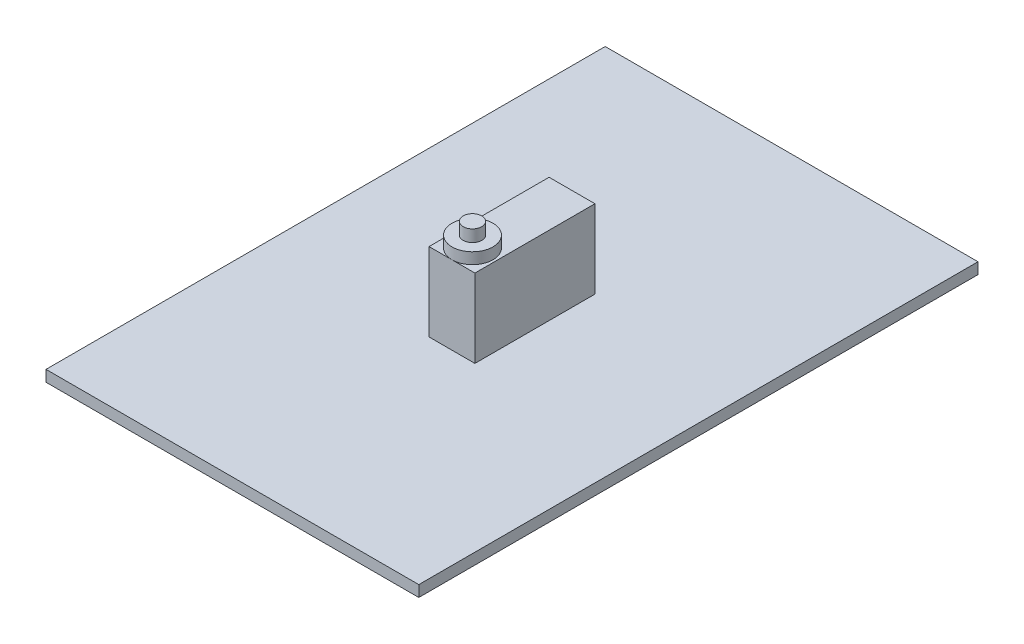
ISO-10303-21;
HEADER;
FILE_DESCRIPTION(('STEP AP214'),'2;1');
FILE_NAME('part.step','',(''),(''),'','','');
FILE_SCHEMA(('AUTOMOTIVE_DESIGN { 1 0 10303 214 1 1 1 1 }'));
ENDSEC;
DATA;
#1=APPLICATION_CONTEXT('core data for automotive mechanical design processes');
#2=APPLICATION_PROTOCOL_DEFINITION('international standard','automotive_design',2000,#1);
#3=PRODUCT_CONTEXT('',#1,'mechanical');
#4=PRODUCT('Part','Part','',(#3));
#5=PRODUCT_RELATED_PRODUCT_CATEGORY('part','',(#4));
#6=PRODUCT_DEFINITION_FORMATION('','',#4);
#7=PRODUCT_DEFINITION_CONTEXT('part definition',#1,'design');
#8=PRODUCT_DEFINITION('design','',#6,#7);
#9=PRODUCT_DEFINITION_SHAPE('','',#8);
#10=(LENGTH_UNIT() NAMED_UNIT(*) SI_UNIT(.MILLI.,.METRE.));
#11=(NAMED_UNIT(*) PLANE_ANGLE_UNIT() SI_UNIT($,.RADIAN.));
#12=(NAMED_UNIT(*) SI_UNIT($,.STERADIAN.) SOLID_ANGLE_UNIT());
#13=UNCERTAINTY_MEASURE_WITH_UNIT(LENGTH_MEASURE(1.E-05),#10,'distance_accuracy_value','');
#14=(GEOMETRIC_REPRESENTATION_CONTEXT(3) GLOBAL_UNCERTAINTY_ASSIGNED_CONTEXT((#13)) GLOBAL_UNIT_ASSIGNED_CONTEXT((#10,
#11,#12)) REPRESENTATION_CONTEXT('',''));
#15=CARTESIAN_POINT('',(0.,0.,0.));
#16=DIRECTION('',(0.,0.,1.));
#17=DIRECTION('',(1.,0.,0.));
#18=AXIS2_PLACEMENT_3D('',#15,#16,#17);
#19=CARTESIAN_POINT('',(0.,1.5,-150.));
#20=DIRECTION('',(0.,1.,0.));
#21=DIRECTION('',(-1.,0.,0.));
#22=AXIS2_PLACEMENT_3D('',#19,#20,#21);
#23=PLANE('',#22);
#24=DIRECTION('',(-1.,0.,0.));
#25=VECTOR('',#24,1.);
#26=CARTESIAN_POINT('',(0.,1.5,0.));
#27=LINE('',#26,#25);
#28=CARTESIAN_POINT('',(50.,1.50000000000001,0.));
#29=VERTEX_POINT('',#28);
#30=CARTESIAN_POINT('',(-50.,1.49999999999999,0.));
#31=VERTEX_POINT('',#30);
#32=EDGE_CURVE('E169',#29,#31,#27,.T.);
#33=ORIENTED_EDGE('',*,*,#32,.F.);
#34=DIRECTION('',(0.,0.,1.));
#35=VECTOR('',#34,1.);
#36=CARTESIAN_POINT('',(50.,1.50000000000001,-150.));
#37=LINE('',#36,#35);
#38=CARTESIAN_POINT('',(50.,1.50000000000001,-150.));
#39=VERTEX_POINT('',#38);
#40=EDGE_CURVE('E195',#39,#29,#37,.T.);
#41=ORIENTED_EDGE('',*,*,#40,.F.);
#42=DIRECTION('',(-1.,0.,0.));
#43=VECTOR('',#42,1.);
#44=CARTESIAN_POINT('',(0.,1.5,-150.));
#45=LINE('',#44,#43);
#46=CARTESIAN_POINT('',(-50.,1.49999999999999,-150.));
#47=VERTEX_POINT('',#46);
#48=EDGE_CURVE('E176',#39,#47,#45,.T.);
#49=ORIENTED_EDGE('',*,*,#48,.T.);
#50=DIRECTION('',(0.,0.,1.));
#51=VECTOR('',#50,1.);
#52=CARTESIAN_POINT('',(-50.,1.49999999999999,-150.));
#53=LINE('',#52,#51);
#54=EDGE_CURVE('E92',#47,#31,#53,.T.);
#55=ORIENTED_EDGE('',*,*,#54,.T.);
#56=EDGE_LOOP('',(#33,#41,#49,#55));
#57=FACE_BOUND('',#56,.T.);
#58=DIRECTION('',(-1.,0.,0.));
#59=VECTOR('',#58,1.);
#60=CARTESIAN_POINT('',(0.,1.5,-58.9));
#61=LINE('',#60,#59);
#62=CARTESIAN_POINT('',(6.15,1.50000000000001,-58.9));
#63=VERTEX_POINT('',#62);
#64=CARTESIAN_POINT('',(-6.15,1.50000000000001,-58.9));
#65=VERTEX_POINT('',#64);
#66=EDGE_CURVE('E210',#63,#65,#61,.T.);
#67=ORIENTED_EDGE('',*,*,#66,.T.);
#68=DIRECTION('',(0.,0.,-1.));
#69=VECTOR('',#68,1.);
#70=CARTESIAN_POINT('',(-6.15,1.5,-150.));
#71=LINE('',#70,#69);
#72=CARTESIAN_POINT('',(-6.15,1.50000000000001,-91.1));
#73=VERTEX_POINT('',#72);
#74=EDGE_CURVE('E48',#65,#73,#71,.T.);
#75=ORIENTED_EDGE('',*,*,#74,.T.);
#76=DIRECTION('',(1.,0.,0.));
#77=VECTOR('',#76,1.);
#78=CARTESIAN_POINT('',(0.,1.5,-91.1));
#79=LINE('',#78,#77);
#80=CARTESIAN_POINT('',(6.15,1.5,-91.1));
#81=VERTEX_POINT('',#80);
#82=EDGE_CURVE('E194',#73,#81,#79,.T.);
#83=ORIENTED_EDGE('',*,*,#82,.T.);
#84=DIRECTION('',(0.,0.,1.));
#85=VECTOR('',#84,1.);
#86=CARTESIAN_POINT('',(6.15,1.5,-150.));
#87=LINE('',#86,#85);
#88=EDGE_CURVE('E207',#81,#63,#87,.T.);
#89=ORIENTED_EDGE('',*,*,#88,.T.);
#90=EDGE_LOOP('',(#67,#75,#83,#89));
#91=FACE_BOUND('',#90,.T.);
#92=ADVANCED_FACE('F44',(#57,#91),#23,.T.);
#93=CARTESIAN_POINT('',(-50.,0.,-150.));
#94=DIRECTION('',(1.,0.,0.));
#95=DIRECTION('',(0.,0.,-1.));
#96=AXIS2_PLACEMENT_3D('',#93,#94,#95);
#97=PLANE('',#96);
#98=DIRECTION('',(0.,1.,0.));
#99=VECTOR('',#98,1.);
#100=CARTESIAN_POINT('',(-50.,0.,0.));
#101=LINE('',#100,#99);
#102=CARTESIAN_POINT('',(-50.,-1.50000000000001,0.));
#103=VERTEX_POINT('',#102);
#104=EDGE_CURVE('E166',#103,#31,#101,.T.);
#105=ORIENTED_EDGE('',*,*,#104,.T.);
#106=ORIENTED_EDGE('',*,*,#54,.F.);
#107=DIRECTION('',(0.,1.,0.));
#108=VECTOR('',#107,1.);
#109=CARTESIAN_POINT('',(-50.,0.,-150.));
#110=LINE('',#109,#108);
#111=CARTESIAN_POINT('',(-50.,-1.50000000000001,-150.));
#112=VERTEX_POINT('',#111);
#113=EDGE_CURVE('E70',#112,#47,#110,.T.);
#114=ORIENTED_EDGE('',*,*,#113,.F.);
#115=DIRECTION('',(0.,0.,1.));
#116=VECTOR('',#115,1.);
#117=CARTESIAN_POINT('',(-50.,-1.50000000000001,-150.));
#118=LINE('',#117,#116);
#119=EDGE_CURVE('E179',#112,#103,#118,.T.);
#120=ORIENTED_EDGE('',*,*,#119,.T.);
#121=EDGE_LOOP('',(#105,#106,#114,#120));
#122=FACE_BOUND('',#121,.T.);
#123=ADVANCED_FACE('F46',(#122),#97,.F.);
#124=CARTESIAN_POINT('',(50.,0.,-150.));
#125=DIRECTION('',(1.,0.,0.));
#126=DIRECTION('',(0.,0.,-1.));
#127=AXIS2_PLACEMENT_3D('',#124,#125,#126);
#128=PLANE('',#127);
#129=DIRECTION('',(0.,1.,0.));
#130=VECTOR('',#129,1.);
#131=CARTESIAN_POINT('',(50.,0.,0.));
#132=LINE('',#131,#130);
#133=CARTESIAN_POINT('',(50.,-1.49999999999999,0.));
#134=VERTEX_POINT('',#133);
#135=EDGE_CURVE('E185',#134,#29,#132,.T.);
#136=ORIENTED_EDGE('',*,*,#135,.F.);
#137=DIRECTION('',(0.,0.,1.));
#138=VECTOR('',#137,1.);
#139=CARTESIAN_POINT('',(50.,-1.49999999999999,-150.));
#140=LINE('',#139,#138);
#141=CARTESIAN_POINT('',(50.,-1.49999999999999,-150.));
#142=VERTEX_POINT('',#141);
#143=EDGE_CURVE('E198',#142,#134,#140,.T.);
#144=ORIENTED_EDGE('',*,*,#143,.F.);
#145=DIRECTION('',(0.,1.,0.));
#146=VECTOR('',#145,1.);
#147=CARTESIAN_POINT('',(50.,0.,-150.));
#148=LINE('',#147,#146);
#149=EDGE_CURVE('E172',#142,#39,#148,.T.);
#150=ORIENTED_EDGE('',*,*,#149,.T.);
#151=ORIENTED_EDGE('',*,*,#40,.T.);
#152=EDGE_LOOP('',(#136,#144,#150,#151));
#153=FACE_BOUND('',#152,.T.);
#154=ADVANCED_FACE('F236',(#153),#128,.T.);
#155=CARTESIAN_POINT('',(0.,-1.5,-150.));
#156=DIRECTION('',(0.,1.,0.));
#157=DIRECTION('',(-1.,0.,0.));
#158=AXIS2_PLACEMENT_3D('',#155,#156,#157);
#159=PLANE('',#158);
#160=DIRECTION('',(-1.,0.,0.));
#161=VECTOR('',#160,1.);
#162=CARTESIAN_POINT('',(0.,-1.5,0.));
#163=LINE('',#162,#161);
#164=EDGE_CURVE('E182',#134,#103,#163,.T.);
#165=ORIENTED_EDGE('',*,*,#164,.T.);
#166=ORIENTED_EDGE('',*,*,#119,.F.);
#167=DIRECTION('',(-1.,0.,0.));
#168=VECTOR('',#167,1.);
#169=CARTESIAN_POINT('',(0.,-1.5,-150.));
#170=LINE('',#169,#168);
#171=EDGE_CURVE('E97',#142,#112,#170,.T.);
#172=ORIENTED_EDGE('',*,*,#171,.F.);
#173=ORIENTED_EDGE('',*,*,#143,.T.);
#174=EDGE_LOOP('',(#165,#166,#172,#173));
#175=FACE_BOUND('',#174,.T.);
#176=ADVANCED_FACE('F243',(#175),#159,.F.);
#177=CARTESIAN_POINT('',(0.,0.,-150.));
#178=DIRECTION('',(0.,0.,1.));
#179=DIRECTION('',(1.,0.,0.));
#180=AXIS2_PLACEMENT_3D('',#177,#178,#179);
#181=PLANE('',#180);
#182=ORIENTED_EDGE('',*,*,#113,.T.);
#183=ORIENTED_EDGE('',*,*,#48,.F.);
#184=ORIENTED_EDGE('',*,*,#149,.F.);
#185=ORIENTED_EDGE('',*,*,#171,.T.);
#186=EDGE_LOOP('',(#182,#183,#184,#185));
#187=FACE_BOUND('',#186,.T.);
#188=ADVANCED_FACE('F246',(#187),#181,.F.);
#189=CARTESIAN_POINT('',(0.,0.,0.));
#190=DIRECTION('',(0.,0.,1.));
#191=DIRECTION('',(1.,0.,0.));
#192=AXIS2_PLACEMENT_3D('',#189,#190,#191);
#193=PLANE('',#192);
#194=ORIENTED_EDGE('',*,*,#104,.F.);
#195=ORIENTED_EDGE('',*,*,#164,.F.);
#196=ORIENTED_EDGE('',*,*,#135,.T.);
#197=ORIENTED_EDGE('',*,*,#32,.T.);
#198=EDGE_LOOP('',(#194,#195,#196,#197));
#199=FACE_BOUND('',#198,.T.);
#200=ADVANCED_FACE('F240',(#199),#193,.T.);
#201=CARTESIAN_POINT('',(-6.15,22.5,-58.9));
#202=DIRECTION('',(1.,0.,0.));
#203=DIRECTION('',(0.,0.,-1.));
#204=AXIS2_PLACEMENT_3D('',#201,#202,#203);
#205=PLANE('',#204);
#206=ORIENTED_EDGE('',*,*,#74,.F.);
#207=DIRECTION('',(0.,-1.,0.));
#208=VECTOR('',#207,1.);
#209=CARTESIAN_POINT('',(-6.15,22.5,-58.9));
#210=LINE('',#209,#208);
#211=CARTESIAN_POINT('',(-6.15,22.5,-58.9));
#212=VERTEX_POINT('',#211);
#213=EDGE_CURVE('E163',#212,#65,#210,.T.);
#214=ORIENTED_EDGE('',*,*,#213,.F.);
#215=DIRECTION('',(0.,0.,1.));
#216=VECTOR('',#215,1.);
#217=CARTESIAN_POINT('',(-6.15,22.5,-58.9));
#218=LINE('',#217,#216);
#219=CARTESIAN_POINT('',(-6.15,22.5,-91.1));
#220=VERTEX_POINT('',#219);
#221=EDGE_CURVE('E131',#220,#212,#218,.T.);
#222=ORIENTED_EDGE('',*,*,#221,.F.);
#223=DIRECTION('',(0.,-1.,0.));
#224=VECTOR('',#223,1.);
#225=CARTESIAN_POINT('',(-6.15,22.5,-91.1));
#226=LINE('',#225,#224);
#227=EDGE_CURVE('E155',#220,#73,#226,.T.);
#228=ORIENTED_EDGE('',*,*,#227,.T.);
#229=EDGE_LOOP('',(#206,#214,#222,#228));
#230=FACE_BOUND('',#229,.T.);
#231=ADVANCED_FACE('F217',(#230),#205,.F.);
#232=CARTESIAN_POINT('',(6.15,22.5,-58.9));
#233=DIRECTION('',(0.,0.,-1.));
#234=DIRECTION('',(-1.,0.,0.));
#235=AXIS2_PLACEMENT_3D('',#232,#233,#234);
#236=PLANE('',#235);
#237=ORIENTED_EDGE('',*,*,#66,.F.);
#238=DIRECTION('',(0.,-1.,0.));
#239=VECTOR('',#238,1.);
#240=CARTESIAN_POINT('',(6.15,22.5,-58.9));
#241=LINE('',#240,#239);
#242=CARTESIAN_POINT('',(6.15,22.5,-58.9));
#243=VERTEX_POINT('',#242);
#244=EDGE_CURVE('E142',#243,#63,#241,.T.);
#245=ORIENTED_EDGE('',*,*,#244,.F.);
#246=DIRECTION('',(1.,0.,0.));
#247=VECTOR('',#246,1.);
#248=CARTESIAN_POINT('',(6.15,22.5,-58.9));
#249=LINE('',#248,#247);
#250=CARTESIAN_POINT('',(0.,22.5,-58.9));
#251=VERTEX_POINT('',#250);
#252=EDGE_CURVE('E137',#251,#243,#249,.T.);
#253=ORIENTED_EDGE('',*,*,#252,.F.);
#254=EDGE_CURVE('E125',#212,#251,#249,.T.);
#255=ORIENTED_EDGE('',*,*,#254,.F.);
#256=ORIENTED_EDGE('',*,*,#213,.T.);
#257=EDGE_LOOP('',(#237,#245,#253,#255,#256));
#258=FACE_BOUND('',#257,.T.);
#259=ADVANCED_FACE('F140',(#258),#236,.F.);
#260=CARTESIAN_POINT('',(6.15,22.5,-58.9));
#261=DIRECTION('',(-1.,0.,0.));
#262=DIRECTION('',(0.,0.,1.));
#263=AXIS2_PLACEMENT_3D('',#260,#261,#262);
#264=PLANE('',#263);
#265=ORIENTED_EDGE('',*,*,#88,.F.);
#266=DIRECTION('',(0.,-1.,0.));
#267=VECTOR('',#266,1.);
#268=CARTESIAN_POINT('',(6.15,22.5,-91.1));
#269=LINE('',#268,#267);
#270=CARTESIAN_POINT('',(6.15,22.5,-91.1));
#271=VERTEX_POINT('',#270);
#272=EDGE_CURVE('E61',#271,#81,#269,.T.);
#273=ORIENTED_EDGE('',*,*,#272,.F.);
#274=DIRECTION('',(0.,0.,-1.));
#275=VECTOR('',#274,1.);
#276=CARTESIAN_POINT('',(6.15,22.5,-58.9));
#277=LINE('',#276,#275);
#278=EDGE_CURVE('E136',#243,#271,#277,.T.);
#279=ORIENTED_EDGE('',*,*,#278,.F.);
#280=ORIENTED_EDGE('',*,*,#244,.T.);
#281=EDGE_LOOP('',(#265,#273,#279,#280));
#282=FACE_BOUND('',#281,.T.);
#283=ADVANCED_FACE('F220',(#282),#264,.F.);
#284=CARTESIAN_POINT('',(6.15,22.5,-91.1));
#285=DIRECTION('',(0.,0.,1.));
#286=DIRECTION('',(1.,0.,0.));
#287=AXIS2_PLACEMENT_3D('',#284,#285,#286);
#288=PLANE('',#287);
#289=ORIENTED_EDGE('',*,*,#82,.F.);
#290=ORIENTED_EDGE('',*,*,#227,.F.);
#291=DIRECTION('',(-1.,0.,0.));
#292=VECTOR('',#291,1.);
#293=CARTESIAN_POINT('',(6.15,22.5,-91.1));
#294=LINE('',#293,#292);
#295=EDGE_CURVE('E152',#271,#220,#294,.T.);
#296=ORIENTED_EDGE('',*,*,#295,.F.);
#297=ORIENTED_EDGE('',*,*,#272,.T.);
#298=EDGE_LOOP('',(#289,#290,#296,#297));
#299=FACE_BOUND('',#298,.T.);
#300=ADVANCED_FACE('F221',(#299),#288,.F.);
#301=CARTESIAN_POINT('',(0.,22.5,0.));
#302=DIRECTION('',(0.,1.,0.));
#303=DIRECTION('',(0.,0.,1.));
#304=AXIS2_PLACEMENT_3D('',#301,#302,#303);
#305=PLANE('',#304);
#306=ORIENTED_EDGE('',*,*,#254,.T.);
#307=CARTESIAN_POINT('',(0.,22.5,-64.4));
#308=DIRECTION('',(0.,1.,0.));
#309=DIRECTION('',(0.,0.,1.));
#310=AXIS2_PLACEMENT_3D('',#307,#308,#309);
#311=CIRCLE('',#310,5.5);
#312=EDGE_CURVE('E129',#251,#251,#311,.T.);
#313=ORIENTED_EDGE('',*,*,#312,.F.);
#314=ORIENTED_EDGE('',*,*,#252,.T.);
#315=ORIENTED_EDGE('',*,*,#278,.T.);
#316=ORIENTED_EDGE('',*,*,#295,.T.);
#317=ORIENTED_EDGE('',*,*,#221,.T.);
#318=EDGE_LOOP('',(#306,#313,#314,#315,#316,#317));
#319=FACE_BOUND('',#318,.T.);
#320=ADVANCED_FACE('F127',(#319),#305,.T.);
#321=CARTESIAN_POINT('',(0.,25.5,-64.4));
#322=DIRECTION('',(0.,-1.,0.));
#323=DIRECTION('',(0.,0.,-1.));
#324=AXIS2_PLACEMENT_3D('',#321,#322,#323);
#325=CYLINDRICAL_SURFACE('',#324,5.5);
#326=CARTESIAN_POINT('',(0.,25.5,-64.4));
#327=DIRECTION('',(0.,1.,0.));
#328=DIRECTION('',(0.,0.,1.));
#329=AXIS2_PLACEMENT_3D('',#326,#327,#328);
#330=CIRCLE('',#329,5.5);
#331=CARTESIAN_POINT('',(0.,25.5,-58.9));
#332=VERTEX_POINT('',#331);
#333=EDGE_CURVE('E146',#332,#332,#330,.T.);
#334=ORIENTED_EDGE('',*,*,#333,.F.);
#335=EDGE_LOOP('',(#334));
#336=FACE_BOUND('',#335,.T.);
#337=ORIENTED_EDGE('',*,*,#312,.T.);
#338=EDGE_LOOP('',(#337));
#339=FACE_BOUND('',#338,.T.);
#340=ADVANCED_FACE('F228',(#336,#339),#325,.T.);
#341=CARTESIAN_POINT('',(0.,25.5,-64.4));
#342=DIRECTION('',(0.,1.,0.));
#343=DIRECTION('',(0.,0.,1.));
#344=AXIS2_PLACEMENT_3D('',#341,#342,#343);
#345=PLANE('',#344);
#346=CARTESIAN_POINT('',(0.,25.5,-64.4));
#347=DIRECTION('',(0.,1.,0.));
#348=DIRECTION('',(0.,0.,1.));
#349=AXIS2_PLACEMENT_3D('',#346,#347,#348);
#350=CIRCLE('',#349,2.5);
#351=CARTESIAN_POINT('',(0.,25.5,-61.9));
#352=VERTEX_POINT('',#351);
#353=EDGE_CURVE('E11',#352,#352,#350,.T.);
#354=ORIENTED_EDGE('',*,*,#353,.F.);
#355=EDGE_LOOP('',(#354));
#356=FACE_BOUND('',#355,.T.);
#357=ORIENTED_EDGE('',*,*,#333,.T.);
#358=EDGE_LOOP('',(#357));
#359=FACE_BOUND('',#358,.T.);
#360=ADVANCED_FACE('F297',(#356,#359),#345,.T.);
#361=CARTESIAN_POINT('',(0.,28.7,-64.4));
#362=DIRECTION('',(0.,-1.,0.));
#363=DIRECTION('',(0.,0.,-1.));
#364=AXIS2_PLACEMENT_3D('',#361,#362,#363);
#365=CYLINDRICAL_SURFACE('',#364,2.5);
#366=CARTESIAN_POINT('',(0.,28.7,-64.4));
#367=DIRECTION('',(0.,1.,0.));
#368=DIRECTION('',(0.,0.,1.));
#369=AXIS2_PLACEMENT_3D('',#366,#367,#368);
#370=CIRCLE('',#369,2.5);
#371=CARTESIAN_POINT('',(0.,28.7,-61.9));
#372=VERTEX_POINT('',#371);
#373=EDGE_CURVE('E340',#372,#372,#370,.T.);
#374=ORIENTED_EDGE('',*,*,#373,.F.);
#375=EDGE_LOOP('',(#374));
#376=FACE_BOUND('',#375,.T.);
#377=ORIENTED_EDGE('',*,*,#353,.T.);
#378=EDGE_LOOP('',(#377));
#379=FACE_BOUND('',#378,.T.);
#380=ADVANCED_FACE('F308',(#376,#379),#365,.T.);
#381=CARTESIAN_POINT('',(0.,28.7,-64.4));
#382=DIRECTION('',(0.,1.,0.));
#383=DIRECTION('',(0.,0.,1.));
#384=AXIS2_PLACEMENT_3D('',#381,#382,#383);
#385=PLANE('',#384);
#386=ORIENTED_EDGE('',*,*,#373,.T.);
#387=EDGE_LOOP('',(#386));
#388=FACE_BOUND('',#387,.T.);
#389=ADVANCED_FACE('F319',(#388),#385,.T.);
#390=CLOSED_SHELL('',(#92,#123,#154,#176,#188,#200,#231,#259,#283,#300,#320,#340,#360,#380,#389));
#391=MANIFOLD_SOLID_BREP('B2',#390);
#392=ADVANCED_BREP_SHAPE_REPRESENTATION('',(#18,#391),#14);
#393=SHAPE_DEFINITION_REPRESENTATION(#9,#392);
ENDSEC;
END-ISO-10303-21;
